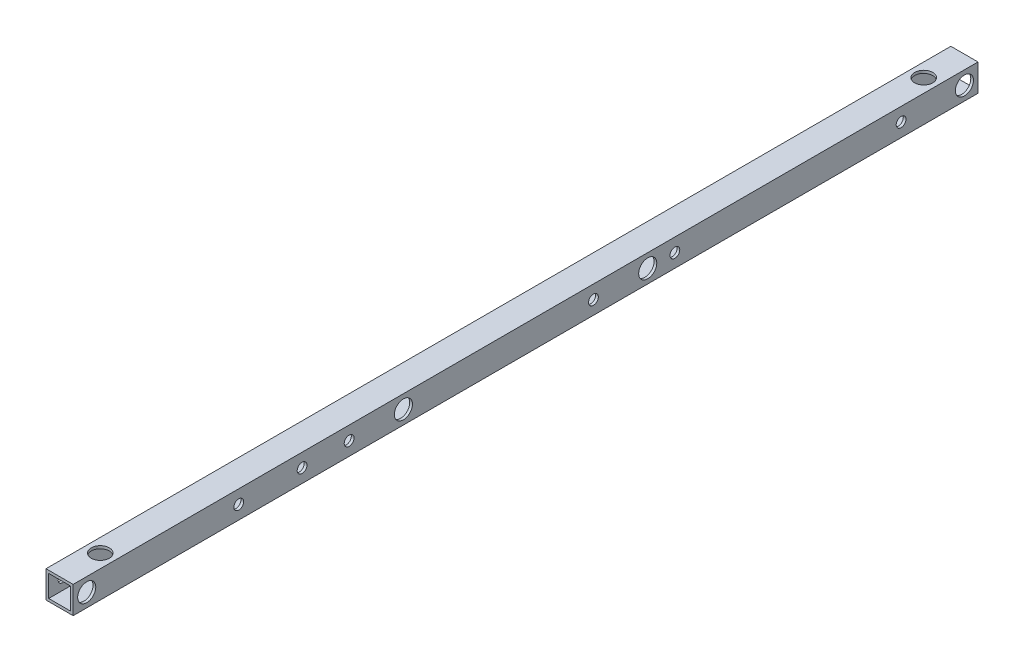
ISO-10303-21;
HEADER;
FILE_DESCRIPTION(('STEP AP214'),'2;1');
FILE_NAME('part.step','',(''),(''),'','','');
FILE_SCHEMA(('AUTOMOTIVE_DESIGN { 1 0 10303 214 1 1 1 1 }'));
ENDSEC;
DATA;
#1=APPLICATION_CONTEXT('core data for automotive mechanical design processes');
#2=APPLICATION_PROTOCOL_DEFINITION('international standard','automotive_design',2000,#1);
#3=PRODUCT_CONTEXT('',#1,'mechanical');
#4=PRODUCT('Part','Part','',(#3));
#5=PRODUCT_RELATED_PRODUCT_CATEGORY('part','',(#4));
#6=PRODUCT_DEFINITION_FORMATION('','',#4);
#7=PRODUCT_DEFINITION_CONTEXT('part definition',#1,'design');
#8=PRODUCT_DEFINITION('design','',#6,#7);
#9=PRODUCT_DEFINITION_SHAPE('','',#8);
#10=(LENGTH_UNIT() NAMED_UNIT(*) SI_UNIT(.MILLI.,.METRE.));
#11=(NAMED_UNIT(*) PLANE_ANGLE_UNIT() SI_UNIT($,.RADIAN.));
#12=(NAMED_UNIT(*) SI_UNIT($,.STERADIAN.) SOLID_ANGLE_UNIT());
#13=UNCERTAINTY_MEASURE_WITH_UNIT(LENGTH_MEASURE(1.E-05),#10,'distance_accuracy_value','');
#14=(GEOMETRIC_REPRESENTATION_CONTEXT(3) GLOBAL_UNCERTAINTY_ASSIGNED_CONTEXT((#13)) GLOBAL_UNIT_ASSIGNED_CONTEXT((#10,
#11,#12)) REPRESENTATION_CONTEXT('',''));
#15=CARTESIAN_POINT('',(0.,0.,0.));
#16=DIRECTION('',(0.,0.,1.));
#17=DIRECTION('',(1.,0.,0.));
#18=AXIS2_PLACEMENT_3D('',#15,#16,#17);
#19=CARTESIAN_POINT('',(-6.,-6.,500.));
#20=DIRECTION('',(1.,0.,0.));
#21=DIRECTION('',(0.,0.,-1.));
#22=AXIS2_PLACEMENT_3D('',#19,#20,#21);
#23=PLANE('',#22);
#24=CARTESIAN_POINT('',(-6.,0.,212.5));
#25=DIRECTION('',(1.,0.,0.));
#26=DIRECTION('',(0.,0.,-1.));
#27=AXIS2_PLACEMENT_3D('',#24,#25,#26);
#28=CIRCLE('',#27,4.99999999999999);
#29=CARTESIAN_POINT('',(-6.,0.,207.5));
#30=VERTEX_POINT('',#29);
#31=EDGE_CURVE('E489',#30,#30,#28,.F.);
#32=ORIENTED_EDGE('',*,*,#31,.T.);
#33=EDGE_LOOP('',(#32));
#34=FACE_BOUND('',#33,.T.);
#35=CARTESIAN_POINT('',(-6.,0.,42.5));
#36=DIRECTION('',(1.,0.,0.));
#37=DIRECTION('',(0.,0.,-1.));
#38=AXIS2_PLACEMENT_3D('',#35,#36,#37);
#39=CIRCLE('',#38,4.99999999999999);
#40=CARTESIAN_POINT('',(-6.,0.,37.5));
#41=VERTEX_POINT('',#40);
#42=EDGE_CURVE('E504',#41,#41,#39,.F.);
#43=ORIENTED_EDGE('',*,*,#42,.T.);
#44=EDGE_LOOP('',(#43));
#45=FACE_BOUND('',#44,.T.);
#46=CARTESIAN_POINT('',(-6.,0.,373.5));
#47=DIRECTION('',(1.,0.,0.));
#48=DIRECTION('',(0.,0.,-1.));
#49=AXIS2_PLACEMENT_3D('',#46,#47,#48);
#50=CIRCLE('',#49,4.99999999999999);
#51=CARTESIAN_POINT('',(-6.,0.,368.5));
#52=VERTEX_POINT('',#51);
#53=EDGE_CURVE('E512',#52,#52,#50,.F.);
#54=ORIENTED_EDGE('',*,*,#53,.T.);
#55=EDGE_LOOP('',(#54));
#56=FACE_BOUND('',#55,.T.);
#57=CARTESIAN_POINT('',(-6.,0.,408.5));
#58=DIRECTION('',(1.,0.,0.));
#59=DIRECTION('',(0.,0.,-1.));
#60=AXIS2_PLACEMENT_3D('',#57,#58,#59);
#61=CIRCLE('',#60,4.99999999999999);
#62=CARTESIAN_POINT('',(-6.,0.,403.5));
#63=VERTEX_POINT('',#62);
#64=EDGE_CURVE('E520',#63,#63,#61,.F.);
#65=ORIENTED_EDGE('',*,*,#64,.T.);
#66=EDGE_LOOP('',(#65));
#67=FACE_BOUND('',#66,.T.);
#68=CARTESIAN_POINT('',(-6.,0.,492.5));
#69=DIRECTION('',(1.,0.,0.));
#70=DIRECTION('',(0.,0.,-1.));
#71=AXIS2_PLACEMENT_3D('',#68,#69,#70);
#72=CIRCLE('',#71,2.24999999999995);
#73=CARTESIAN_POINT('',(-6.,0.,490.25));
#74=VERTEX_POINT('',#73);
#75=EDGE_CURVE('E227',#74,#74,#72,.T.);
#76=ORIENTED_EDGE('',*,*,#75,.F.);
#77=EDGE_LOOP('',(#76));
#78=FACE_BOUND('',#77,.T.);
#79=CARTESIAN_POINT('',(-6.,0.,317.5));
#80=DIRECTION('',(1.,0.,0.));
#81=DIRECTION('',(0.,0.,-1.));
#82=AXIS2_PLACEMENT_3D('',#79,#80,#81);
#83=CIRCLE('',#82,2.24999999999995);
#84=CARTESIAN_POINT('',(-6.,0.,315.25));
#85=VERTEX_POINT('',#84);
#86=EDGE_CURVE('E222',#85,#85,#83,.T.);
#87=ORIENTED_EDGE('',*,*,#86,.F.);
#88=EDGE_LOOP('',(#87));
#89=FACE_BOUND('',#88,.T.);
#90=CARTESIAN_POINT('',(-6.,0.,182.5));
#91=DIRECTION('',(1.,0.,0.));
#92=DIRECTION('',(0.,0.,-1.));
#93=AXIS2_PLACEMENT_3D('',#90,#91,#92);
#94=CIRCLE('',#93,2.25000000000001);
#95=CARTESIAN_POINT('',(-6.,0.,180.25));
#96=VERTEX_POINT('',#95);
#97=EDGE_CURVE('E217',#96,#96,#94,.T.);
#98=ORIENTED_EDGE('',*,*,#97,.F.);
#99=EDGE_LOOP('',(#98));
#100=FACE_BOUND('',#99,.T.);
#101=CARTESIAN_POINT('',(-6.,0.,7.5));
#102=DIRECTION('',(1.,0.,0.));
#103=DIRECTION('',(0.,0.,-1.));
#104=AXIS2_PLACEMENT_3D('',#101,#102,#103);
#105=CIRCLE('',#104,2.25);
#106=CARTESIAN_POINT('',(-6.,0.,5.25));
#107=VERTEX_POINT('',#106);
#108=EDGE_CURVE('E211',#107,#107,#105,.T.);
#109=ORIENTED_EDGE('',*,*,#108,.F.);
#110=EDGE_LOOP('',(#109));
#111=FACE_BOUND('',#110,.T.);
#112=DIRECTION('',(0.,-1.,0.));
#113=VECTOR('',#112,1.);
#114=CARTESIAN_POINT('',(-6.,-6.,0.));
#115=LINE('',#114,#113);
#116=CARTESIAN_POINT('',(-6.,6.,0.));
#117=VERTEX_POINT('',#116);
#118=CARTESIAN_POINT('',(-6.,-6.,0.));
#119=VERTEX_POINT('',#118);
#120=EDGE_CURVE('E162',#117,#119,#115,.T.);
#121=ORIENTED_EDGE('',*,*,#120,.F.);
#122=DIRECTION('',(0.,0.,-1.));
#123=VECTOR('',#122,1.);
#124=CARTESIAN_POINT('',(-6.,6.,500.));
#125=LINE('',#124,#123);
#126=CARTESIAN_POINT('',(-6.,6.,500.));
#127=VERTEX_POINT('',#126);
#128=EDGE_CURVE('E142',#127,#117,#125,.T.);
#129=ORIENTED_EDGE('',*,*,#128,.F.);
#130=DIRECTION('',(0.,-1.,0.));
#131=VECTOR('',#130,1.);
#132=CARTESIAN_POINT('',(-6.,-6.,500.));
#133=LINE('',#132,#131);
#134=CARTESIAN_POINT('',(-6.,-6.,500.));
#135=VERTEX_POINT('',#134);
#136=EDGE_CURVE('E146',#127,#135,#133,.T.);
#137=ORIENTED_EDGE('',*,*,#136,.T.);
#138=DIRECTION('',(0.,0.,-1.));
#139=VECTOR('',#138,1.);
#140=CARTESIAN_POINT('',(-6.,-6.,500.));
#141=LINE('',#140,#139);
#142=EDGE_CURVE('E73',#135,#119,#141,.T.);
#143=ORIENTED_EDGE('',*,*,#142,.T.);
#144=EDGE_LOOP('',(#121,#129,#137,#143));
#145=FACE_BOUND('',#144,.T.);
#146=CARTESIAN_POINT('',(-6.,0.,167.5));
#147=DIRECTION('',(1.,0.,0.));
#148=DIRECTION('',(0.,0.,-1.));
#149=AXIS2_PLACEMENT_3D('',#146,#147,#148);
#150=CIRCLE('',#149,4.99999999999999);
#151=CARTESIAN_POINT('',(-6.,0.,162.5));
#152=VERTEX_POINT('',#151);
#153=EDGE_CURVE('E496',#152,#152,#150,.F.);
#154=ORIENTED_EDGE('',*,*,#153,.T.);
#155=EDGE_LOOP('',(#154));
#156=FACE_BOUND('',#155,.T.);
#157=CARTESIAN_POINT('',(-6.,0.,347.5));
#158=DIRECTION('',(1.,0.,0.));
#159=DIRECTION('',(0.,0.,-1.));
#160=AXIS2_PLACEMENT_3D('',#157,#158,#159);
#161=CIRCLE('',#160,4.99999999999999);
#162=CARTESIAN_POINT('',(-6.,0.,342.5));
#163=VERTEX_POINT('',#162);
#164=EDGE_CURVE('E475',#163,#163,#161,.F.);
#165=ORIENTED_EDGE('',*,*,#164,.T.);
#166=EDGE_LOOP('',(#165));
#167=FACE_BOUND('',#166,.T.);
#168=ADVANCED_FACE('F55',(#34,#45,#56,#67,#78,#89,#100,#111,#145,#156,#167),#23,.T.);
#169=CARTESIAN_POINT('',(-7.5,-7.5,500.));
#170=DIRECTION('',(1.,0.,0.));
#171=DIRECTION('',(0.,0.,-1.));
#172=AXIS2_PLACEMENT_3D('',#169,#170,#171);
#173=PLANE('',#172);
#174=CARTESIAN_POINT('',(-7.5,0.,347.5));
#175=DIRECTION('',(-1.,0.,0.));
#176=DIRECTION('',(0.,0.,1.));
#177=AXIS2_PLACEMENT_3D('',#174,#175,#176);
#178=CIRCLE('',#177,4.99999999999999);
#179=CARTESIAN_POINT('',(-7.5,0.,352.5));
#180=VERTEX_POINT('',#179);
#181=EDGE_CURVE('E478',#180,#180,#178,.T.);
#182=ORIENTED_EDGE('',*,*,#181,.F.);
#183=EDGE_LOOP('',(#182));
#184=FACE_BOUND('',#183,.T.);
#185=DIRECTION('',(0.,-1.,0.));
#186=VECTOR('',#185,1.);
#187=CARTESIAN_POINT('',(-7.5,-7.5,0.));
#188=LINE('',#187,#186);
#189=CARTESIAN_POINT('',(-7.5,7.5,0.));
#190=VERTEX_POINT('',#189);
#191=CARTESIAN_POINT('',(-7.5,-7.5,0.));
#192=VERTEX_POINT('',#191);
#193=EDGE_CURVE('E196',#190,#192,#188,.T.);
#194=ORIENTED_EDGE('',*,*,#193,.T.);
#195=DIRECTION('',(0.,0.,-1.));
#196=VECTOR('',#195,1.);
#197=CARTESIAN_POINT('',(-7.5,-7.5,500.));
#198=LINE('',#197,#196);
#199=CARTESIAN_POINT('',(-7.5,-7.5,500.));
#200=VERTEX_POINT('',#199);
#201=EDGE_CURVE('E204',#200,#192,#198,.T.);
#202=ORIENTED_EDGE('',*,*,#201,.F.);
#203=DIRECTION('',(0.,-1.,0.));
#204=VECTOR('',#203,1.);
#205=CARTESIAN_POINT('',(-7.5,-7.5,500.));
#206=LINE('',#205,#204);
#207=CARTESIAN_POINT('',(-7.5,7.5,500.));
#208=VERTEX_POINT('',#207);
#209=EDGE_CURVE('E183',#208,#200,#206,.T.);
#210=ORIENTED_EDGE('',*,*,#209,.F.);
#211=DIRECTION('',(0.,0.,-1.));
#212=VECTOR('',#211,1.);
#213=CARTESIAN_POINT('',(-7.5,7.5,500.));
#214=LINE('',#213,#212);
#215=EDGE_CURVE('E65',#208,#190,#214,.T.);
#216=ORIENTED_EDGE('',*,*,#215,.T.);
#217=EDGE_LOOP('',(#194,#202,#210,#216));
#218=FACE_BOUND('',#217,.T.);
#219=CARTESIAN_POINT('',(-7.5,0.,7.5));
#220=DIRECTION('',(1.,0.,0.));
#221=DIRECTION('',(0.,0.,-1.));
#222=AXIS2_PLACEMENT_3D('',#219,#220,#221);
#223=CIRCLE('',#222,2.25);
#224=CARTESIAN_POINT('',(-7.5,0.,5.25));
#225=VERTEX_POINT('',#224);
#226=EDGE_CURVE('E215',#225,#225,#223,.T.);
#227=ORIENTED_EDGE('',*,*,#226,.T.);
#228=EDGE_LOOP('',(#227));
#229=FACE_BOUND('',#228,.T.);
#230=CARTESIAN_POINT('',(-7.5,0.,182.5));
#231=DIRECTION('',(1.,0.,0.));
#232=DIRECTION('',(0.,0.,-1.));
#233=AXIS2_PLACEMENT_3D('',#230,#231,#232);
#234=CIRCLE('',#233,2.25000000000001);
#235=CARTESIAN_POINT('',(-7.5,0.,180.25));
#236=VERTEX_POINT('',#235);
#237=EDGE_CURVE('E221',#236,#236,#234,.T.);
#238=ORIENTED_EDGE('',*,*,#237,.T.);
#239=EDGE_LOOP('',(#238));
#240=FACE_BOUND('',#239,.T.);
#241=CARTESIAN_POINT('',(-7.5,0.,317.5));
#242=DIRECTION('',(1.,0.,0.));
#243=DIRECTION('',(0.,0.,-1.));
#244=AXIS2_PLACEMENT_3D('',#241,#242,#243);
#245=CIRCLE('',#244,2.24999999999995);
#246=CARTESIAN_POINT('',(-7.5,0.,315.25));
#247=VERTEX_POINT('',#246);
#248=EDGE_CURVE('E226',#247,#247,#245,.T.);
#249=ORIENTED_EDGE('',*,*,#248,.T.);
#250=EDGE_LOOP('',(#249));
#251=FACE_BOUND('',#250,.T.);
#252=CARTESIAN_POINT('',(-7.5,0.,492.5));
#253=DIRECTION('',(1.,0.,0.));
#254=DIRECTION('',(0.,0.,-1.));
#255=AXIS2_PLACEMENT_3D('',#252,#253,#254);
#256=CIRCLE('',#255,2.24999999999995);
#257=CARTESIAN_POINT('',(-7.5,0.,490.25));
#258=VERTEX_POINT('',#257);
#259=EDGE_CURVE('E159',#258,#258,#256,.T.);
#260=ORIENTED_EDGE('',*,*,#259,.T.);
#261=EDGE_LOOP('',(#260));
#262=FACE_BOUND('',#261,.T.);
#263=CARTESIAN_POINT('',(-7.5,0.,408.5));
#264=DIRECTION('',(-1.,0.,0.));
#265=DIRECTION('',(0.,0.,1.));
#266=AXIS2_PLACEMENT_3D('',#263,#264,#265);
#267=CIRCLE('',#266,4.99999999999999);
#268=CARTESIAN_POINT('',(-7.5,0.,413.5));
#269=VERTEX_POINT('',#268);
#270=EDGE_CURVE('E516',#269,#269,#267,.T.);
#271=ORIENTED_EDGE('',*,*,#270,.F.);
#272=EDGE_LOOP('',(#271));
#273=FACE_BOUND('',#272,.T.);
#274=CARTESIAN_POINT('',(-7.5,0.,373.5));
#275=DIRECTION('',(-1.,0.,0.));
#276=DIRECTION('',(0.,0.,1.));
#277=AXIS2_PLACEMENT_3D('',#274,#275,#276);
#278=CIRCLE('',#277,4.99999999999999);
#279=CARTESIAN_POINT('',(-7.5,0.,378.5));
#280=VERTEX_POINT('',#279);
#281=EDGE_CURVE('E508',#280,#280,#278,.T.);
#282=ORIENTED_EDGE('',*,*,#281,.F.);
#283=EDGE_LOOP('',(#282));
#284=FACE_BOUND('',#283,.T.);
#285=CARTESIAN_POINT('',(-7.5,0.,42.5));
#286=DIRECTION('',(-1.,0.,0.));
#287=DIRECTION('',(0.,0.,1.));
#288=AXIS2_PLACEMENT_3D('',#285,#286,#287);
#289=CIRCLE('',#288,4.99999999999999);
#290=CARTESIAN_POINT('',(-7.5,0.,47.5));
#291=VERTEX_POINT('',#290);
#292=EDGE_CURVE('E500',#291,#291,#289,.T.);
#293=ORIENTED_EDGE('',*,*,#292,.F.);
#294=EDGE_LOOP('',(#293));
#295=FACE_BOUND('',#294,.T.);
#296=CARTESIAN_POINT('',(-7.5,0.,167.5));
#297=DIRECTION('',(-1.,0.,0.));
#298=DIRECTION('',(0.,0.,1.));
#299=AXIS2_PLACEMENT_3D('',#296,#297,#298);
#300=CIRCLE('',#299,4.99999999999999);
#301=CARTESIAN_POINT('',(-7.5,0.,172.5));
#302=VERTEX_POINT('',#301);
#303=EDGE_CURVE('E492',#302,#302,#300,.T.);
#304=ORIENTED_EDGE('',*,*,#303,.F.);
#305=EDGE_LOOP('',(#304));
#306=FACE_BOUND('',#305,.T.);
#307=CARTESIAN_POINT('',(-7.5,0.,212.5));
#308=DIRECTION('',(-1.,0.,0.));
#309=DIRECTION('',(0.,0.,1.));
#310=AXIS2_PLACEMENT_3D('',#307,#308,#309);
#311=CIRCLE('',#310,4.99999999999999);
#312=CARTESIAN_POINT('',(-7.5,0.,217.5));
#313=VERTEX_POINT('',#312);
#314=EDGE_CURVE('E483',#313,#313,#311,.T.);
#315=ORIENTED_EDGE('',*,*,#314,.F.);
#316=EDGE_LOOP('',(#315));
#317=FACE_BOUND('',#316,.T.);
#318=ADVANCED_FACE('F300',(#184,#218,#229,#240,#251,#262,#273,#284,#295,#306,#317),#173,.F.);
#319=CARTESIAN_POINT('',(0.,0.,500.));
#320=DIRECTION('',(0.,0.,-1.));
#321=DIRECTION('',(-1.,0.,0.));
#322=AXIS2_PLACEMENT_3D('',#319,#320,#321);
#323=PLANE('',#322);
#324=DIRECTION('',(0.,1.,0.));
#325=VECTOR('',#324,1.);
#326=CARTESIAN_POINT('',(7.5,-7.5,500.));
#327=LINE('',#326,#325);
#328=CARTESIAN_POINT('',(7.5,-7.5,500.));
#329=VERTEX_POINT('',#328);
#330=CARTESIAN_POINT('',(7.5,7.5,500.));
#331=VERTEX_POINT('',#330);
#332=EDGE_CURVE('E175',#329,#331,#327,.T.);
#333=ORIENTED_EDGE('',*,*,#332,.T.);
#334=DIRECTION('',(-1.,0.,0.));
#335=VECTOR('',#334,1.);
#336=CARTESIAN_POINT('',(-7.5,7.5,500.));
#337=LINE('',#336,#335);
#338=EDGE_CURVE('E179',#331,#208,#337,.T.);
#339=ORIENTED_EDGE('',*,*,#338,.T.);
#340=ORIENTED_EDGE('',*,*,#209,.T.);
#341=DIRECTION('',(1.,0.,0.));
#342=VECTOR('',#341,1.);
#343=CARTESIAN_POINT('',(-7.5,-7.5,500.));
#344=LINE('',#343,#342);
#345=EDGE_CURVE('E186',#200,#329,#344,.T.);
#346=ORIENTED_EDGE('',*,*,#345,.T.);
#347=EDGE_LOOP('',(#333,#339,#340,#346));
#348=FACE_BOUND('',#347,.T.);
#349=DIRECTION('',(0.,1.,0.));
#350=VECTOR('',#349,1.);
#351=CARTESIAN_POINT('',(6.,-6.,500.));
#352=LINE('',#351,#350);
#353=CARTESIAN_POINT('',(6.,-6.,500.));
#354=VERTEX_POINT('',#353);
#355=CARTESIAN_POINT('',(6.,6.,500.));
#356=VERTEX_POINT('',#355);
#357=EDGE_CURVE('E123',#354,#356,#352,.T.);
#358=ORIENTED_EDGE('',*,*,#357,.F.);
#359=DIRECTION('',(1.,0.,0.));
#360=VECTOR('',#359,1.);
#361=CARTESIAN_POINT('',(-6.,-6.,500.));
#362=LINE('',#361,#360);
#363=EDGE_CURVE('E151',#135,#354,#362,.T.);
#364=ORIENTED_EDGE('',*,*,#363,.F.);
#365=ORIENTED_EDGE('',*,*,#136,.F.);
#366=DIRECTION('',(-1.,0.,0.));
#367=VECTOR('',#366,1.);
#368=CARTESIAN_POINT('',(-6.,6.,500.));
#369=LINE('',#368,#367);
#370=EDGE_CURVE('E132',#356,#127,#369,.T.);
#371=ORIENTED_EDGE('',*,*,#370,.F.);
#372=EDGE_LOOP('',(#358,#364,#365,#371));
#373=FACE_BOUND('',#372,.T.);
#374=ADVANCED_FACE('F145',(#348,#373),#323,.F.);
#375=CARTESIAN_POINT('',(0.,0.,0.));
#376=DIRECTION('',(0.,0.,-1.));
#377=DIRECTION('',(-1.,0.,0.));
#378=AXIS2_PLACEMENT_3D('',#375,#376,#377);
#379=PLANE('',#378);
#380=DIRECTION('',(0.,1.,0.));
#381=VECTOR('',#380,1.);
#382=CARTESIAN_POINT('',(7.5,-7.5,0.));
#383=LINE('',#382,#381);
#384=CARTESIAN_POINT('',(7.5,-7.5,0.));
#385=VERTEX_POINT('',#384);
#386=CARTESIAN_POINT('',(7.5,7.5,0.));
#387=VERTEX_POINT('',#386);
#388=EDGE_CURVE('E141',#385,#387,#383,.T.);
#389=ORIENTED_EDGE('',*,*,#388,.F.);
#390=DIRECTION('',(1.,0.,0.));
#391=VECTOR('',#390,1.);
#392=CARTESIAN_POINT('',(-7.5,-7.5,0.));
#393=LINE('',#392,#391);
#394=EDGE_CURVE('E180',#192,#385,#393,.T.);
#395=ORIENTED_EDGE('',*,*,#394,.F.);
#396=ORIENTED_EDGE('',*,*,#193,.F.);
#397=DIRECTION('',(-1.,0.,0.));
#398=VECTOR('',#397,1.);
#399=CARTESIAN_POINT('',(-7.5,7.5,0.));
#400=LINE('',#399,#398);
#401=EDGE_CURVE('E193',#387,#190,#400,.T.);
#402=ORIENTED_EDGE('',*,*,#401,.F.);
#403=EDGE_LOOP('',(#389,#395,#396,#402));
#404=FACE_BOUND('',#403,.T.);
#405=DIRECTION('',(1.,0.,0.));
#406=VECTOR('',#405,1.);
#407=CARTESIAN_POINT('',(-6.,-6.,0.));
#408=LINE('',#407,#406);
#409=CARTESIAN_POINT('',(6.,-6.,0.));
#410=VERTEX_POINT('',#409);
#411=EDGE_CURVE('E133',#119,#410,#408,.T.);
#412=ORIENTED_EDGE('',*,*,#411,.T.);
#413=DIRECTION('',(0.,1.,0.));
#414=VECTOR('',#413,1.);
#415=CARTESIAN_POINT('',(6.,-6.,0.));
#416=LINE('',#415,#414);
#417=CARTESIAN_POINT('',(6.,6.,0.));
#418=VERTEX_POINT('',#417);
#419=EDGE_CURVE('E81',#410,#418,#416,.T.);
#420=ORIENTED_EDGE('',*,*,#419,.T.);
#421=DIRECTION('',(-1.,0.,0.));
#422=VECTOR('',#421,1.);
#423=CARTESIAN_POINT('',(-6.,6.,0.));
#424=LINE('',#423,#422);
#425=EDGE_CURVE('E139',#418,#117,#424,.T.);
#426=ORIENTED_EDGE('',*,*,#425,.T.);
#427=ORIENTED_EDGE('',*,*,#120,.T.);
#428=EDGE_LOOP('',(#412,#420,#426,#427));
#429=FACE_BOUND('',#428,.T.);
#430=ADVANCED_FACE('F344',(#404,#429),#379,.T.);
#431=CARTESIAN_POINT('',(7.5,-7.5,500.));
#432=DIRECTION('',(-1.,0.,0.));
#433=DIRECTION('',(0.,0.,1.));
#434=AXIS2_PLACEMENT_3D('',#431,#432,#433);
#435=PLANE('',#434);
#436=CARTESIAN_POINT('',(7.5,0.,347.5));
#437=DIRECTION('',(1.,0.,0.));
#438=DIRECTION('',(0.,0.,-1.));
#439=AXIS2_PLACEMENT_3D('',#436,#437,#438);
#440=CIRCLE('',#439,2.69999999999999);
#441=CARTESIAN_POINT('',(7.5,0.,344.8));
#442=VERTEX_POINT('',#441);
#443=EDGE_CURVE('E524',#442,#442,#440,.T.);
#444=ORIENTED_EDGE('',*,*,#443,.F.);
#445=EDGE_LOOP('',(#444));
#446=FACE_BOUND('',#445,.T.);
#447=CARTESIAN_POINT('',(7.5,0.,212.5));
#448=DIRECTION('',(1.,0.,0.));
#449=DIRECTION('',(0.,0.,-1.));
#450=AXIS2_PLACEMENT_3D('',#447,#448,#449);
#451=CIRCLE('',#450,2.69999999999999);
#452=CARTESIAN_POINT('',(7.5,0.,209.8));
#453=VERTEX_POINT('',#452);
#454=EDGE_CURVE('E532',#453,#453,#451,.T.);
#455=ORIENTED_EDGE('',*,*,#454,.F.);
#456=EDGE_LOOP('',(#455));
#457=FACE_BOUND('',#456,.T.);
#458=CARTESIAN_POINT('',(7.5,0.,167.5));
#459=DIRECTION('',(1.,0.,0.));
#460=DIRECTION('',(0.,0.,-1.));
#461=AXIS2_PLACEMENT_3D('',#458,#459,#460);
#462=CIRCLE('',#461,2.69999999999999);
#463=CARTESIAN_POINT('',(7.5,0.,164.8));
#464=VERTEX_POINT('',#463);
#465=EDGE_CURVE('E540',#464,#464,#462,.T.);
#466=ORIENTED_EDGE('',*,*,#465,.F.);
#467=EDGE_LOOP('',(#466));
#468=FACE_BOUND('',#467,.T.);
#469=CARTESIAN_POINT('',(7.5,0.,42.5));
#470=DIRECTION('',(1.,0.,0.));
#471=DIRECTION('',(0.,0.,-1.));
#472=AXIS2_PLACEMENT_3D('',#469,#470,#471);
#473=CIRCLE('',#472,2.69999999999999);
#474=CARTESIAN_POINT('',(7.5,0.,39.8));
#475=VERTEX_POINT('',#474);
#476=EDGE_CURVE('E548',#475,#475,#473,.T.);
#477=ORIENTED_EDGE('',*,*,#476,.F.);
#478=EDGE_LOOP('',(#477));
#479=FACE_BOUND('',#478,.T.);
#480=CARTESIAN_POINT('',(7.5,0.,373.5));
#481=DIRECTION('',(1.,0.,0.));
#482=DIRECTION('',(0.,0.,-1.));
#483=AXIS2_PLACEMENT_3D('',#480,#481,#482);
#484=CIRCLE('',#483,2.69999999999999);
#485=CARTESIAN_POINT('',(7.5,0.,370.8));
#486=VERTEX_POINT('',#485);
#487=EDGE_CURVE('E556',#486,#486,#484,.T.);
#488=ORIENTED_EDGE('',*,*,#487,.F.);
#489=EDGE_LOOP('',(#488));
#490=FACE_BOUND('',#489,.T.);
#491=CARTESIAN_POINT('',(7.5,0.,408.5));
#492=DIRECTION('',(1.,0.,0.));
#493=DIRECTION('',(0.,0.,-1.));
#494=AXIS2_PLACEMENT_3D('',#491,#492,#493);
#495=CIRCLE('',#494,2.69999999999999);
#496=CARTESIAN_POINT('',(7.5,0.,405.8));
#497=VERTEX_POINT('',#496);
#498=EDGE_CURVE('E560',#497,#497,#495,.T.);
#499=ORIENTED_EDGE('',*,*,#498,.F.);
#500=EDGE_LOOP('',(#499));
#501=FACE_BOUND('',#500,.T.);
#502=CARTESIAN_POINT('',(7.5,0.,492.5));
#503=DIRECTION('',(1.,0.,0.));
#504=DIRECTION('',(0.,0.,-1.));
#505=AXIS2_PLACEMENT_3D('',#502,#503,#504);
#506=CIRCLE('',#505,4.99999999999999);
#507=CARTESIAN_POINT('',(7.5,0.,487.5));
#508=VERTEX_POINT('',#507);
#509=EDGE_CURVE('E244',#508,#508,#506,.T.);
#510=ORIENTED_EDGE('',*,*,#509,.F.);
#511=EDGE_LOOP('',(#510));
#512=FACE_BOUND('',#511,.T.);
#513=CARTESIAN_POINT('',(7.5,0.,7.5));
#514=DIRECTION('',(1.,0.,0.));
#515=DIRECTION('',(0.,0.,-1.));
#516=AXIS2_PLACEMENT_3D('',#513,#514,#515);
#517=CIRCLE('',#516,5.);
#518=CARTESIAN_POINT('',(7.5,0.,2.5));
#519=VERTEX_POINT('',#518);
#520=EDGE_CURVE('E277',#519,#519,#517,.T.);
#521=ORIENTED_EDGE('',*,*,#520,.F.);
#522=EDGE_LOOP('',(#521));
#523=FACE_BOUND('',#522,.T.);
#524=CARTESIAN_POINT('',(7.5,0.,182.5));
#525=DIRECTION('',(1.,0.,0.));
#526=DIRECTION('',(0.,0.,-1.));
#527=AXIS2_PLACEMENT_3D('',#524,#525,#526);
#528=CIRCLE('',#527,4.99999999999999);
#529=CARTESIAN_POINT('',(7.5,0.,177.5));
#530=VERTEX_POINT('',#529);
#531=EDGE_CURVE('E270',#530,#530,#528,.T.);
#532=ORIENTED_EDGE('',*,*,#531,.F.);
#533=EDGE_LOOP('',(#532));
#534=FACE_BOUND('',#533,.T.);
#535=CARTESIAN_POINT('',(7.5,0.,317.5));
#536=DIRECTION('',(1.,0.,0.));
#537=DIRECTION('',(0.,0.,-1.));
#538=AXIS2_PLACEMENT_3D('',#535,#536,#537);
#539=CIRCLE('',#538,4.99999999999999);
#540=CARTESIAN_POINT('',(7.5,0.,312.5));
#541=VERTEX_POINT('',#540);
#542=EDGE_CURVE('E264',#541,#541,#539,.T.);
#543=ORIENTED_EDGE('',*,*,#542,.F.);
#544=EDGE_LOOP('',(#543));
#545=FACE_BOUND('',#544,.T.);
#546=ORIENTED_EDGE('',*,*,#388,.T.);
#547=DIRECTION('',(0.,0.,-1.));
#548=VECTOR('',#547,1.);
#549=CARTESIAN_POINT('',(7.5,7.5,500.));
#550=LINE('',#549,#548);
#551=EDGE_CURVE('E13',#331,#387,#550,.T.);
#552=ORIENTED_EDGE('',*,*,#551,.F.);
#553=ORIENTED_EDGE('',*,*,#332,.F.);
#554=DIRECTION('',(0.,0.,-1.));
#555=VECTOR('',#554,1.);
#556=CARTESIAN_POINT('',(7.5,-7.5,500.));
#557=LINE('',#556,#555);
#558=EDGE_CURVE('E189',#329,#385,#557,.T.);
#559=ORIENTED_EDGE('',*,*,#558,.T.);
#560=EDGE_LOOP('',(#546,#552,#553,#559));
#561=FACE_BOUND('',#560,.T.);
#562=ADVANCED_FACE('F57',(#446,#457,#468,#479,#490,#501,#512,#523,#534,#545,#561),#435,.F.);
#563=CARTESIAN_POINT('',(-7.5,7.5,500.));
#564=DIRECTION('',(0.,-1.,0.));
#565=DIRECTION('',(0.,0.,-1.));
#566=AXIS2_PLACEMENT_3D('',#563,#564,#565);
#567=PLANE('',#566);
#568=CARTESIAN_POINT('',(9.26342336171615E-13,7.5,22.5));
#569=DIRECTION('',(0.,1.,0.));
#570=DIRECTION('',(0.,0.,1.));
#571=AXIS2_PLACEMENT_3D('',#568,#569,#570);
#572=CIRCLE('',#571,5.);
#573=CARTESIAN_POINT('',(9.26342336171615E-13,7.5,27.5));
#574=VERTEX_POINT('',#573);
#575=EDGE_CURVE('E261',#574,#574,#572,.T.);
#576=ORIENTED_EDGE('',*,*,#575,.F.);
#577=EDGE_LOOP('',(#576));
#578=FACE_BOUND('',#577,.T.);
#579=CARTESIAN_POINT('',(0.,7.5,477.5));
#580=DIRECTION('',(0.,1.,0.));
#581=DIRECTION('',(0.,0.,1.));
#582=AXIS2_PLACEMENT_3D('',#579,#580,#581);
#583=CIRCLE('',#582,5.);
#584=CARTESIAN_POINT('',(0.,7.5,482.5));
#585=VERTEX_POINT('',#584);
#586=EDGE_CURVE('E364',#585,#585,#583,.T.);
#587=ORIENTED_EDGE('',*,*,#586,.F.);
#588=EDGE_LOOP('',(#587));
#589=FACE_BOUND('',#588,.T.);
#590=ORIENTED_EDGE('',*,*,#401,.T.);
#591=ORIENTED_EDGE('',*,*,#215,.F.);
#592=ORIENTED_EDGE('',*,*,#338,.F.);
#593=ORIENTED_EDGE('',*,*,#551,.T.);
#594=EDGE_LOOP('',(#590,#591,#592,#593));
#595=FACE_BOUND('',#594,.T.);
#596=ADVANCED_FACE('F349',(#578,#589,#595),#567,.F.);
#597=CARTESIAN_POINT('',(-7.5,-7.5,500.));
#598=DIRECTION('',(0.,1.,0.));
#599=DIRECTION('',(0.,0.,1.));
#600=AXIS2_PLACEMENT_3D('',#597,#598,#599);
#601=PLANE('',#600);
#602=CARTESIAN_POINT('',(9.26342336171615E-13,-7.5,22.5));
#603=DIRECTION('',(0.,-1.,0.));
#604=DIRECTION('',(0.,0.,-1.));
#605=AXIS2_PLACEMENT_3D('',#602,#603,#604);
#606=CIRCLE('',#605,2.25);
#607=CARTESIAN_POINT('',(9.26342336171615E-13,-7.5,20.25));
#608=VERTEX_POINT('',#607);
#609=EDGE_CURVE('E235',#608,#608,#606,.T.);
#610=ORIENTED_EDGE('',*,*,#609,.F.);
#611=EDGE_LOOP('',(#610));
#612=FACE_BOUND('',#611,.T.);
#613=CARTESIAN_POINT('',(0.,-7.5,477.5));
#614=DIRECTION('',(0.,-1.,0.));
#615=DIRECTION('',(0.,0.,-1.));
#616=AXIS2_PLACEMENT_3D('',#613,#614,#615);
#617=CIRCLE('',#616,2.25);
#618=CARTESIAN_POINT('',(0.,-7.5,475.25));
#619=VERTEX_POINT('',#618);
#620=EDGE_CURVE('E256',#619,#619,#617,.T.);
#621=ORIENTED_EDGE('',*,*,#620,.F.);
#622=EDGE_LOOP('',(#621));
#623=FACE_BOUND('',#622,.T.);
#624=ORIENTED_EDGE('',*,*,#394,.T.);
#625=ORIENTED_EDGE('',*,*,#558,.F.);
#626=ORIENTED_EDGE('',*,*,#345,.F.);
#627=ORIENTED_EDGE('',*,*,#201,.T.);
#628=EDGE_LOOP('',(#624,#625,#626,#627));
#629=FACE_BOUND('',#628,.T.);
#630=ADVANCED_FACE('F340',(#612,#623,#629),#601,.F.);
#631=CARTESIAN_POINT('',(6.,-6.,500.));
#632=DIRECTION('',(-1.,0.,0.));
#633=DIRECTION('',(0.,0.,1.));
#634=AXIS2_PLACEMENT_3D('',#631,#632,#633);
#635=PLANE('',#634);
#636=CARTESIAN_POINT('',(6.,0.,347.5));
#637=DIRECTION('',(-1.,0.,0.));
#638=DIRECTION('',(0.,0.,1.));
#639=AXIS2_PLACEMENT_3D('',#636,#637,#638);
#640=CIRCLE('',#639,2.69999999999999);
#641=CARTESIAN_POINT('',(6.,0.,350.2));
#642=VERTEX_POINT('',#641);
#643=EDGE_CURVE('E528',#642,#642,#640,.T.);
#644=ORIENTED_EDGE('',*,*,#643,.F.);
#645=EDGE_LOOP('',(#644));
#646=FACE_BOUND('',#645,.T.);
#647=CARTESIAN_POINT('',(6.,0.,212.5));
#648=DIRECTION('',(-1.,0.,0.));
#649=DIRECTION('',(0.,0.,1.));
#650=AXIS2_PLACEMENT_3D('',#647,#648,#649);
#651=CIRCLE('',#650,2.69999999999999);
#652=CARTESIAN_POINT('',(6.,0.,215.2));
#653=VERTEX_POINT('',#652);
#654=EDGE_CURVE('E536',#653,#653,#651,.T.);
#655=ORIENTED_EDGE('',*,*,#654,.F.);
#656=EDGE_LOOP('',(#655));
#657=FACE_BOUND('',#656,.T.);
#658=CARTESIAN_POINT('',(6.,0.,167.5));
#659=DIRECTION('',(-1.,0.,0.));
#660=DIRECTION('',(0.,0.,1.));
#661=AXIS2_PLACEMENT_3D('',#658,#659,#660);
#662=CIRCLE('',#661,2.69999999999999);
#663=CARTESIAN_POINT('',(6.,0.,170.2));
#664=VERTEX_POINT('',#663);
#665=EDGE_CURVE('E544',#664,#664,#662,.T.);
#666=ORIENTED_EDGE('',*,*,#665,.F.);
#667=EDGE_LOOP('',(#666));
#668=FACE_BOUND('',#667,.T.);
#669=CARTESIAN_POINT('',(6.,0.,42.5));
#670=DIRECTION('',(-1.,0.,0.));
#671=DIRECTION('',(0.,0.,1.));
#672=AXIS2_PLACEMENT_3D('',#669,#670,#671);
#673=CIRCLE('',#672,2.69999999999999);
#674=CARTESIAN_POINT('',(6.,0.,45.2));
#675=VERTEX_POINT('',#674);
#676=EDGE_CURVE('E552',#675,#675,#673,.T.);
#677=ORIENTED_EDGE('',*,*,#676,.F.);
#678=EDGE_LOOP('',(#677));
#679=FACE_BOUND('',#678,.T.);
#680=CARTESIAN_POINT('',(6.,0.,373.5));
#681=DIRECTION('',(-1.,0.,0.));
#682=DIRECTION('',(0.,0.,1.));
#683=AXIS2_PLACEMENT_3D('',#680,#681,#682);
#684=CIRCLE('',#683,2.69999999999999);
#685=CARTESIAN_POINT('',(6.,0.,376.2));
#686=VERTEX_POINT('',#685);
#687=EDGE_CURVE('E59',#686,#686,#684,.T.);
#688=ORIENTED_EDGE('',*,*,#687,.F.);
#689=EDGE_LOOP('',(#688));
#690=FACE_BOUND('',#689,.T.);
#691=CARTESIAN_POINT('',(6.,0.,408.5));
#692=DIRECTION('',(-1.,0.,0.));
#693=DIRECTION('',(0.,0.,1.));
#694=AXIS2_PLACEMENT_3D('',#691,#692,#693);
#695=CIRCLE('',#694,2.69999999999999);
#696=CARTESIAN_POINT('',(6.,0.,411.2));
#697=VERTEX_POINT('',#696);
#698=EDGE_CURVE('E564',#697,#697,#695,.T.);
#699=ORIENTED_EDGE('',*,*,#698,.F.);
#700=EDGE_LOOP('',(#699));
#701=FACE_BOUND('',#700,.T.);
#702=CARTESIAN_POINT('',(6.,0.,492.5));
#703=DIRECTION('',(-1.,0.,0.));
#704=DIRECTION('',(0.,0.,1.));
#705=AXIS2_PLACEMENT_3D('',#702,#703,#704);
#706=CIRCLE('',#705,4.99999999999999);
#707=CARTESIAN_POINT('',(6.,0.,497.5));
#708=VERTEX_POINT('',#707);
#709=EDGE_CURVE('E252',#708,#708,#706,.T.);
#710=ORIENTED_EDGE('',*,*,#709,.F.);
#711=EDGE_LOOP('',(#710));
#712=FACE_BOUND('',#711,.T.);
#713=CARTESIAN_POINT('',(6.,0.,7.5));
#714=DIRECTION('',(-1.,0.,0.));
#715=DIRECTION('',(0.,0.,1.));
#716=AXIS2_PLACEMENT_3D('',#713,#714,#715);
#717=CIRCLE('',#716,5.);
#718=CARTESIAN_POINT('',(6.,0.,12.5));
#719=VERTEX_POINT('',#718);
#720=EDGE_CURVE('E248',#719,#719,#717,.T.);
#721=ORIENTED_EDGE('',*,*,#720,.F.);
#722=EDGE_LOOP('',(#721));
#723=FACE_BOUND('',#722,.T.);
#724=CARTESIAN_POINT('',(6.,0.,182.5));
#725=DIRECTION('',(-1.,0.,0.));
#726=DIRECTION('',(0.,0.,1.));
#727=AXIS2_PLACEMENT_3D('',#724,#725,#726);
#728=CIRCLE('',#727,4.99999999999999);
#729=CARTESIAN_POINT('',(6.,0.,187.5));
#730=VERTEX_POINT('',#729);
#731=EDGE_CURVE('E243',#730,#730,#728,.T.);
#732=ORIENTED_EDGE('',*,*,#731,.F.);
#733=EDGE_LOOP('',(#732));
#734=FACE_BOUND('',#733,.T.);
#735=CARTESIAN_POINT('',(6.,0.,317.5));
#736=DIRECTION('',(-1.,0.,0.));
#737=DIRECTION('',(0.,0.,1.));
#738=AXIS2_PLACEMENT_3D('',#735,#736,#737);
#739=CIRCLE('',#738,4.99999999999999);
#740=CARTESIAN_POINT('',(6.,0.,322.5));
#741=VERTEX_POINT('',#740);
#742=EDGE_CURVE('E239',#741,#741,#739,.T.);
#743=ORIENTED_EDGE('',*,*,#742,.F.);
#744=EDGE_LOOP('',(#743));
#745=FACE_BOUND('',#744,.T.);
#746=ORIENTED_EDGE('',*,*,#419,.F.);
#747=DIRECTION('',(0.,0.,-1.));
#748=VECTOR('',#747,1.);
#749=CARTESIAN_POINT('',(6.,-6.,500.));
#750=LINE('',#749,#748);
#751=EDGE_CURVE('E127',#354,#410,#750,.T.);
#752=ORIENTED_EDGE('',*,*,#751,.F.);
#753=ORIENTED_EDGE('',*,*,#357,.T.);
#754=DIRECTION('',(0.,0.,-1.));
#755=VECTOR('',#754,1.);
#756=CARTESIAN_POINT('',(6.,6.,500.));
#757=LINE('',#756,#755);
#758=EDGE_CURVE('E126',#356,#418,#757,.T.);
#759=ORIENTED_EDGE('',*,*,#758,.T.);
#760=EDGE_LOOP('',(#746,#752,#753,#759));
#761=FACE_BOUND('',#760,.T.);
#762=ADVANCED_FACE('F125',(#646,#657,#668,#679,#690,#701,#712,#723,#734,#745,#761),#635,.T.);
#763=CARTESIAN_POINT('',(-6.,6.,500.));
#764=DIRECTION('',(0.,-1.,0.));
#765=DIRECTION('',(0.,0.,-1.));
#766=AXIS2_PLACEMENT_3D('',#763,#764,#765);
#767=PLANE('',#766);
#768=CARTESIAN_POINT('',(9.26342336171615E-13,6.,22.5));
#769=DIRECTION('',(0.,-1.,0.));
#770=DIRECTION('',(0.,0.,-1.));
#771=AXIS2_PLACEMENT_3D('',#768,#769,#770);
#772=CIRCLE('',#771,5.);
#773=CARTESIAN_POINT('',(9.26342336171615E-13,6.,17.5));
#774=VERTEX_POINT('',#773);
#775=EDGE_CURVE('E260',#774,#774,#772,.T.);
#776=ORIENTED_EDGE('',*,*,#775,.F.);
#777=EDGE_LOOP('',(#776));
#778=FACE_BOUND('',#777,.T.);
#779=CARTESIAN_POINT('',(0.,6.,477.5));
#780=DIRECTION('',(0.,-1.,0.));
#781=DIRECTION('',(0.,0.,-1.));
#782=AXIS2_PLACEMENT_3D('',#779,#780,#781);
#783=CIRCLE('',#782,5.);
#784=CARTESIAN_POINT('',(0.,6.,472.5));
#785=VERTEX_POINT('',#784);
#786=EDGE_CURVE('E257',#785,#785,#783,.T.);
#787=ORIENTED_EDGE('',*,*,#786,.F.);
#788=EDGE_LOOP('',(#787));
#789=FACE_BOUND('',#788,.T.);
#790=ORIENTED_EDGE('',*,*,#425,.F.);
#791=ORIENTED_EDGE('',*,*,#758,.F.);
#792=ORIENTED_EDGE('',*,*,#370,.T.);
#793=ORIENTED_EDGE('',*,*,#128,.T.);
#794=EDGE_LOOP('',(#790,#791,#792,#793));
#795=FACE_BOUND('',#794,.T.);
#796=ADVANCED_FACE('F136',(#778,#789,#795),#767,.T.);
#797=CARTESIAN_POINT('',(-6.,-6.,500.));
#798=DIRECTION('',(0.,1.,0.));
#799=DIRECTION('',(0.,0.,1.));
#800=AXIS2_PLACEMENT_3D('',#797,#798,#799);
#801=PLANE('',#800);
#802=CARTESIAN_POINT('',(9.26342336171615E-13,-6.,22.5));
#803=DIRECTION('',(0.,1.,0.));
#804=DIRECTION('',(0.,0.,1.));
#805=AXIS2_PLACEMENT_3D('',#802,#803,#804);
#806=CIRCLE('',#805,2.25);
#807=CARTESIAN_POINT('',(9.26342336171615E-13,-6.,24.75));
#808=VERTEX_POINT('',#807);
#809=EDGE_CURVE('E216',#808,#808,#806,.T.);
#810=ORIENTED_EDGE('',*,*,#809,.F.);
#811=EDGE_LOOP('',(#810));
#812=FACE_BOUND('',#811,.T.);
#813=CARTESIAN_POINT('',(0.,-6.,477.5));
#814=DIRECTION('',(0.,1.,0.));
#815=DIRECTION('',(0.,0.,1.));
#816=AXIS2_PLACEMENT_3D('',#813,#814,#815);
#817=CIRCLE('',#816,2.25);
#818=CARTESIAN_POINT('',(0.,-6.,479.75));
#819=VERTEX_POINT('',#818);
#820=EDGE_CURVE('E231',#819,#819,#817,.T.);
#821=ORIENTED_EDGE('',*,*,#820,.F.);
#822=EDGE_LOOP('',(#821));
#823=FACE_BOUND('',#822,.T.);
#824=ORIENTED_EDGE('',*,*,#411,.F.);
#825=ORIENTED_EDGE('',*,*,#142,.F.);
#826=ORIENTED_EDGE('',*,*,#363,.T.);
#827=ORIENTED_EDGE('',*,*,#751,.T.);
#828=EDGE_LOOP('',(#824,#825,#826,#827));
#829=FACE_BOUND('',#828,.T.);
#830=ADVANCED_FACE('F333',(#812,#823,#829),#801,.T.);
#831=CARTESIAN_POINT('',(-17.5,0.,7.5));
#832=DIRECTION('',(1.,0.,0.));
#833=DIRECTION('',(0.,0.,-1.));
#834=AXIS2_PLACEMENT_3D('',#831,#832,#833);
#835=CYLINDRICAL_SURFACE('',#834,2.25);
#836=ORIENTED_EDGE('',*,*,#108,.T.);
#837=EDGE_LOOP('',(#836));
#838=FACE_BOUND('',#837,.T.);
#839=ORIENTED_EDGE('',*,*,#226,.F.);
#840=EDGE_LOOP('',(#839));
#841=FACE_BOUND('',#840,.T.);
#842=ADVANCED_FACE('F382',(#838,#841),#835,.F.);
#843=CARTESIAN_POINT('',(-17.5,0.,182.5));
#844=DIRECTION('',(1.,0.,0.));
#845=DIRECTION('',(0.,0.,-1.));
#846=AXIS2_PLACEMENT_3D('',#843,#844,#845);
#847=CYLINDRICAL_SURFACE('',#846,2.25000000000001);
#848=ORIENTED_EDGE('',*,*,#97,.T.);
#849=EDGE_LOOP('',(#848));
#850=FACE_BOUND('',#849,.T.);
#851=ORIENTED_EDGE('',*,*,#237,.F.);
#852=EDGE_LOOP('',(#851));
#853=FACE_BOUND('',#852,.T.);
#854=ADVANCED_FACE('F317',(#850,#853),#847,.F.);
#855=CARTESIAN_POINT('',(-17.5,0.,317.5));
#856=DIRECTION('',(1.,0.,0.));
#857=DIRECTION('',(0.,0.,-1.));
#858=AXIS2_PLACEMENT_3D('',#855,#856,#857);
#859=CYLINDRICAL_SURFACE('',#858,2.24999999999995);
#860=ORIENTED_EDGE('',*,*,#86,.T.);
#861=EDGE_LOOP('',(#860));
#862=FACE_BOUND('',#861,.T.);
#863=ORIENTED_EDGE('',*,*,#248,.F.);
#864=EDGE_LOOP('',(#863));
#865=FACE_BOUND('',#864,.T.);
#866=ADVANCED_FACE('F306',(#862,#865),#859,.F.);
#867=CARTESIAN_POINT('',(-17.5,0.,492.5));
#868=DIRECTION('',(1.,0.,0.));
#869=DIRECTION('',(0.,0.,-1.));
#870=AXIS2_PLACEMENT_3D('',#867,#868,#869);
#871=CYLINDRICAL_SURFACE('',#870,2.24999999999995);
#872=ORIENTED_EDGE('',*,*,#75,.T.);
#873=EDGE_LOOP('',(#872));
#874=FACE_BOUND('',#873,.T.);
#875=ORIENTED_EDGE('',*,*,#259,.F.);
#876=EDGE_LOOP('',(#875));
#877=FACE_BOUND('',#876,.T.);
#878=ADVANCED_FACE('F303',(#874,#877),#871,.F.);
#879=CARTESIAN_POINT('',(0.,12.5,477.5));
#880=DIRECTION('',(0.,-1.,0.));
#881=DIRECTION('',(0.,0.,-1.));
#882=AXIS2_PLACEMENT_3D('',#879,#880,#881);
#883=CYLINDRICAL_SURFACE('',#882,2.25);
#884=ORIENTED_EDGE('',*,*,#820,.T.);
#885=EDGE_LOOP('',(#884));
#886=FACE_BOUND('',#885,.T.);
#887=ORIENTED_EDGE('',*,*,#620,.T.);
#888=EDGE_LOOP('',(#887));
#889=FACE_BOUND('',#888,.T.);
#890=ADVANCED_FACE('F305',(#886,#889),#883,.F.);
#891=CARTESIAN_POINT('',(9.26342336171615E-13,12.5,22.5));
#892=DIRECTION('',(0.,-1.,0.));
#893=DIRECTION('',(0.,0.,-1.));
#894=AXIS2_PLACEMENT_3D('',#891,#892,#893);
#895=CYLINDRICAL_SURFACE('',#894,2.25);
#896=ORIENTED_EDGE('',*,*,#809,.T.);
#897=EDGE_LOOP('',(#896));
#898=FACE_BOUND('',#897,.T.);
#899=ORIENTED_EDGE('',*,*,#609,.T.);
#900=EDGE_LOOP('',(#899));
#901=FACE_BOUND('',#900,.T.);
#902=ADVANCED_FACE('F314',(#898,#901),#895,.F.);
#903=CARTESIAN_POINT('',(4.2,0.,317.5));
#904=DIRECTION('',(1.,0.,0.));
#905=DIRECTION('',(0.,0.,-1.));
#906=AXIS2_PLACEMENT_3D('',#903,#904,#905);
#907=CYLINDRICAL_SURFACE('',#906,4.99999999999999);
#908=ORIENTED_EDGE('',*,*,#742,.T.);
#909=EDGE_LOOP('',(#908));
#910=FACE_BOUND('',#909,.T.);
#911=ORIENTED_EDGE('',*,*,#542,.T.);
#912=EDGE_LOOP('',(#911));
#913=FACE_BOUND('',#912,.T.);
#914=ADVANCED_FACE('F397',(#910,#913),#907,.F.);
#915=CARTESIAN_POINT('',(4.2,0.,182.5));
#916=DIRECTION('',(1.,0.,0.));
#917=DIRECTION('',(0.,0.,-1.));
#918=AXIS2_PLACEMENT_3D('',#915,#916,#917);
#919=CYLINDRICAL_SURFACE('',#918,4.99999999999999);
#920=ORIENTED_EDGE('',*,*,#731,.T.);
#921=EDGE_LOOP('',(#920));
#922=FACE_BOUND('',#921,.T.);
#923=ORIENTED_EDGE('',*,*,#531,.T.);
#924=EDGE_LOOP('',(#923));
#925=FACE_BOUND('',#924,.T.);
#926=ADVANCED_FACE('F403',(#922,#925),#919,.F.);
#927=CARTESIAN_POINT('',(4.2,0.,7.5));
#928=DIRECTION('',(1.,0.,0.));
#929=DIRECTION('',(0.,0.,-1.));
#930=AXIS2_PLACEMENT_3D('',#927,#928,#929);
#931=CYLINDRICAL_SURFACE('',#930,5.);
#932=ORIENTED_EDGE('',*,*,#720,.T.);
#933=EDGE_LOOP('',(#932));
#934=FACE_BOUND('',#933,.T.);
#935=ORIENTED_EDGE('',*,*,#520,.T.);
#936=EDGE_LOOP('',(#935));
#937=FACE_BOUND('',#936,.T.);
#938=ADVANCED_FACE('F409',(#934,#937),#931,.F.);
#939=CARTESIAN_POINT('',(4.2,0.,492.5));
#940=DIRECTION('',(1.,0.,0.));
#941=DIRECTION('',(0.,0.,-1.));
#942=AXIS2_PLACEMENT_3D('',#939,#940,#941);
#943=CYLINDRICAL_SURFACE('',#942,4.99999999999999);
#944=ORIENTED_EDGE('',*,*,#709,.T.);
#945=EDGE_LOOP('',(#944));
#946=FACE_BOUND('',#945,.T.);
#947=ORIENTED_EDGE('',*,*,#509,.T.);
#948=EDGE_LOOP('',(#947));
#949=FACE_BOUND('',#948,.T.);
#950=ADVANCED_FACE('F413',(#946,#949),#943,.F.);
#951=CARTESIAN_POINT('',(0.,4.2,477.5));
#952=DIRECTION('',(0.,1.,0.));
#953=DIRECTION('',(0.,0.,1.));
#954=AXIS2_PLACEMENT_3D('',#951,#952,#953);
#955=CYLINDRICAL_SURFACE('',#954,5.);
#956=ORIENTED_EDGE('',*,*,#786,.T.);
#957=EDGE_LOOP('',(#956));
#958=FACE_BOUND('',#957,.T.);
#959=ORIENTED_EDGE('',*,*,#586,.T.);
#960=EDGE_LOOP('',(#959));
#961=FACE_BOUND('',#960,.T.);
#962=ADVANCED_FACE('F416',(#958,#961),#955,.F.);
#963=CARTESIAN_POINT('',(9.26342336171615E-13,4.2,22.5));
#964=DIRECTION('',(0.,1.,0.));
#965=DIRECTION('',(0.,0.,1.));
#966=AXIS2_PLACEMENT_3D('',#963,#964,#965);
#967=CYLINDRICAL_SURFACE('',#966,5.);
#968=ORIENTED_EDGE('',*,*,#775,.T.);
#969=EDGE_LOOP('',(#968));
#970=FACE_BOUND('',#969,.T.);
#971=ORIENTED_EDGE('',*,*,#575,.T.);
#972=EDGE_LOOP('',(#971));
#973=FACE_BOUND('',#972,.T.);
#974=ADVANCED_FACE('F420',(#970,#973),#967,.F.);
#975=CARTESIAN_POINT('',(7.5,0.,408.5));
#976=DIRECTION('',(1.,0.,0.));
#977=DIRECTION('',(0.,0.,-1.));
#978=AXIS2_PLACEMENT_3D('',#975,#976,#977);
#979=CYLINDRICAL_SURFACE('',#978,2.69999999999999);
#980=ORIENTED_EDGE('',*,*,#698,.T.);
#981=EDGE_LOOP('',(#980));
#982=FACE_BOUND('',#981,.T.);
#983=ORIENTED_EDGE('',*,*,#498,.T.);
#984=EDGE_LOOP('',(#983));
#985=FACE_BOUND('',#984,.T.);
#986=ADVANCED_FACE('F424',(#982,#985),#979,.F.);
#987=CARTESIAN_POINT('',(7.5,0.,373.5));
#988=DIRECTION('',(1.,0.,0.));
#989=DIRECTION('',(0.,0.,-1.));
#990=AXIS2_PLACEMENT_3D('',#987,#988,#989);
#991=CYLINDRICAL_SURFACE('',#990,2.69999999999999);
#992=ORIENTED_EDGE('',*,*,#687,.T.);
#993=EDGE_LOOP('',(#992));
#994=FACE_BOUND('',#993,.T.);
#995=ORIENTED_EDGE('',*,*,#487,.T.);
#996=EDGE_LOOP('',(#995));
#997=FACE_BOUND('',#996,.T.);
#998=ADVANCED_FACE('F427',(#994,#997),#991,.F.);
#999=CARTESIAN_POINT('',(7.5,0.,42.5));
#1000=DIRECTION('',(1.,0.,0.));
#1001=DIRECTION('',(0.,0.,-1.));
#1002=AXIS2_PLACEMENT_3D('',#999,#1000,#1001);
#1003=CYLINDRICAL_SURFACE('',#1002,2.69999999999999);
#1004=ORIENTED_EDGE('',*,*,#676,.T.);
#1005=EDGE_LOOP('',(#1004));
#1006=FACE_BOUND('',#1005,.T.);
#1007=ORIENTED_EDGE('',*,*,#476,.T.);
#1008=EDGE_LOOP('',(#1007));
#1009=FACE_BOUND('',#1008,.T.);
#1010=ADVANCED_FACE('F431',(#1006,#1009),#1003,.F.);
#1011=CARTESIAN_POINT('',(7.5,0.,167.5));
#1012=DIRECTION('',(1.,0.,0.));
#1013=DIRECTION('',(0.,0.,-1.));
#1014=AXIS2_PLACEMENT_3D('',#1011,#1012,#1013);
#1015=CYLINDRICAL_SURFACE('',#1014,2.69999999999999);
#1016=ORIENTED_EDGE('',*,*,#665,.T.);
#1017=EDGE_LOOP('',(#1016));
#1018=FACE_BOUND('',#1017,.T.);
#1019=ORIENTED_EDGE('',*,*,#465,.T.);
#1020=EDGE_LOOP('',(#1019));
#1021=FACE_BOUND('',#1020,.T.);
#1022=ADVANCED_FACE('F435',(#1018,#1021),#1015,.F.);
#1023=CARTESIAN_POINT('',(7.5,0.,212.5));
#1024=DIRECTION('',(1.,0.,0.));
#1025=DIRECTION('',(0.,0.,-1.));
#1026=AXIS2_PLACEMENT_3D('',#1023,#1024,#1025);
#1027=CYLINDRICAL_SURFACE('',#1026,2.69999999999999);
#1028=ORIENTED_EDGE('',*,*,#654,.T.);
#1029=EDGE_LOOP('',(#1028));
#1030=FACE_BOUND('',#1029,.T.);
#1031=ORIENTED_EDGE('',*,*,#454,.T.);
#1032=EDGE_LOOP('',(#1031));
#1033=FACE_BOUND('',#1032,.T.);
#1034=ADVANCED_FACE('F439',(#1030,#1033),#1027,.F.);
#1035=CARTESIAN_POINT('',(7.5,0.,347.5));
#1036=DIRECTION('',(1.,0.,0.));
#1037=DIRECTION('',(0.,0.,-1.));
#1038=AXIS2_PLACEMENT_3D('',#1035,#1036,#1037);
#1039=CYLINDRICAL_SURFACE('',#1038,2.69999999999999);
#1040=ORIENTED_EDGE('',*,*,#643,.T.);
#1041=EDGE_LOOP('',(#1040));
#1042=FACE_BOUND('',#1041,.T.);
#1043=ORIENTED_EDGE('',*,*,#443,.T.);
#1044=EDGE_LOOP('',(#1043));
#1045=FACE_BOUND('',#1044,.T.);
#1046=ADVANCED_FACE('F443',(#1042,#1045),#1039,.F.);
#1047=CARTESIAN_POINT('',(-7.5,0.,408.5));
#1048=DIRECTION('',(-1.,0.,0.));
#1049=DIRECTION('',(0.,0.,1.));
#1050=AXIS2_PLACEMENT_3D('',#1047,#1048,#1049);
#1051=CYLINDRICAL_SURFACE('',#1050,4.99999999999999);
#1052=ORIENTED_EDGE('',*,*,#64,.F.);
#1053=EDGE_LOOP('',(#1052));
#1054=FACE_BOUND('',#1053,.T.);
#1055=ORIENTED_EDGE('',*,*,#270,.T.);
#1056=EDGE_LOOP('',(#1055));
#1057=FACE_BOUND('',#1056,.T.);
#1058=ADVANCED_FACE('F446',(#1054,#1057),#1051,.F.);
#1059=CARTESIAN_POINT('',(-7.5,0.,373.5));
#1060=DIRECTION('',(-1.,0.,0.));
#1061=DIRECTION('',(0.,0.,1.));
#1062=AXIS2_PLACEMENT_3D('',#1059,#1060,#1061);
#1063=CYLINDRICAL_SURFACE('',#1062,4.99999999999999);
#1064=ORIENTED_EDGE('',*,*,#53,.F.);
#1065=EDGE_LOOP('',(#1064));
#1066=FACE_BOUND('',#1065,.T.);
#1067=ORIENTED_EDGE('',*,*,#281,.T.);
#1068=EDGE_LOOP('',(#1067));
#1069=FACE_BOUND('',#1068,.T.);
#1070=ADVANCED_FACE('F450',(#1066,#1069),#1063,.F.);
#1071=CARTESIAN_POINT('',(-7.5,0.,42.5));
#1072=DIRECTION('',(-1.,0.,0.));
#1073=DIRECTION('',(0.,0.,1.));
#1074=AXIS2_PLACEMENT_3D('',#1071,#1072,#1073);
#1075=CYLINDRICAL_SURFACE('',#1074,4.99999999999999);
#1076=ORIENTED_EDGE('',*,*,#42,.F.);
#1077=EDGE_LOOP('',(#1076));
#1078=FACE_BOUND('',#1077,.T.);
#1079=ORIENTED_EDGE('',*,*,#292,.T.);
#1080=EDGE_LOOP('',(#1079));
#1081=FACE_BOUND('',#1080,.T.);
#1082=ADVANCED_FACE('F454',(#1078,#1081),#1075,.F.);
#1083=CARTESIAN_POINT('',(-7.5,0.,167.5));
#1084=DIRECTION('',(-1.,0.,0.));
#1085=DIRECTION('',(0.,0.,1.));
#1086=AXIS2_PLACEMENT_3D('',#1083,#1084,#1085);
#1087=CYLINDRICAL_SURFACE('',#1086,4.99999999999999);
#1088=ORIENTED_EDGE('',*,*,#153,.F.);
#1089=EDGE_LOOP('',(#1088));
#1090=FACE_BOUND('',#1089,.T.);
#1091=ORIENTED_EDGE('',*,*,#303,.T.);
#1092=EDGE_LOOP('',(#1091));
#1093=FACE_BOUND('',#1092,.T.);
#1094=ADVANCED_FACE('F458',(#1090,#1093),#1087,.F.);
#1095=CARTESIAN_POINT('',(-7.5,0.,212.5));
#1096=DIRECTION('',(-1.,0.,0.));
#1097=DIRECTION('',(0.,0.,1.));
#1098=AXIS2_PLACEMENT_3D('',#1095,#1096,#1097);
#1099=CYLINDRICAL_SURFACE('',#1098,4.99999999999999);
#1100=ORIENTED_EDGE('',*,*,#31,.F.);
#1101=EDGE_LOOP('',(#1100));
#1102=FACE_BOUND('',#1101,.T.);
#1103=ORIENTED_EDGE('',*,*,#314,.T.);
#1104=EDGE_LOOP('',(#1103));
#1105=FACE_BOUND('',#1104,.T.);
#1106=ADVANCED_FACE('F462',(#1102,#1105),#1099,.F.);
#1107=CARTESIAN_POINT('',(-7.5,0.,347.5));
#1108=DIRECTION('',(-1.,0.,0.));
#1109=DIRECTION('',(0.,0.,1.));
#1110=AXIS2_PLACEMENT_3D('',#1107,#1108,#1109);
#1111=CYLINDRICAL_SURFACE('',#1110,4.99999999999999);
#1112=ORIENTED_EDGE('',*,*,#164,.F.);
#1113=EDGE_LOOP('',(#1112));
#1114=FACE_BOUND('',#1113,.T.);
#1115=ORIENTED_EDGE('',*,*,#181,.T.);
#1116=EDGE_LOOP('',(#1115));
#1117=FACE_BOUND('',#1116,.T.);
#1118=ADVANCED_FACE('F466',(#1114,#1117),#1111,.F.);
#1119=CLOSED_SHELL('',(#168,#318,#374,#430,#562,#596,#630,#762,#796,#830,#842,#854,#866,#878,
#890,#902,#914,#926,#938,#950,#962,#974,#986,#998,#1010,#1022,#1034,#1046,#1058,#1070,#1082,
#1094,#1106,#1118));
#1120=MANIFOLD_SOLID_BREP('B2',#1119);
#1121=ADVANCED_BREP_SHAPE_REPRESENTATION('',(#18,#1120),#14);
#1122=SHAPE_DEFINITION_REPRESENTATION(#9,#1121);
ENDSEC;
END-ISO-10303-21;
